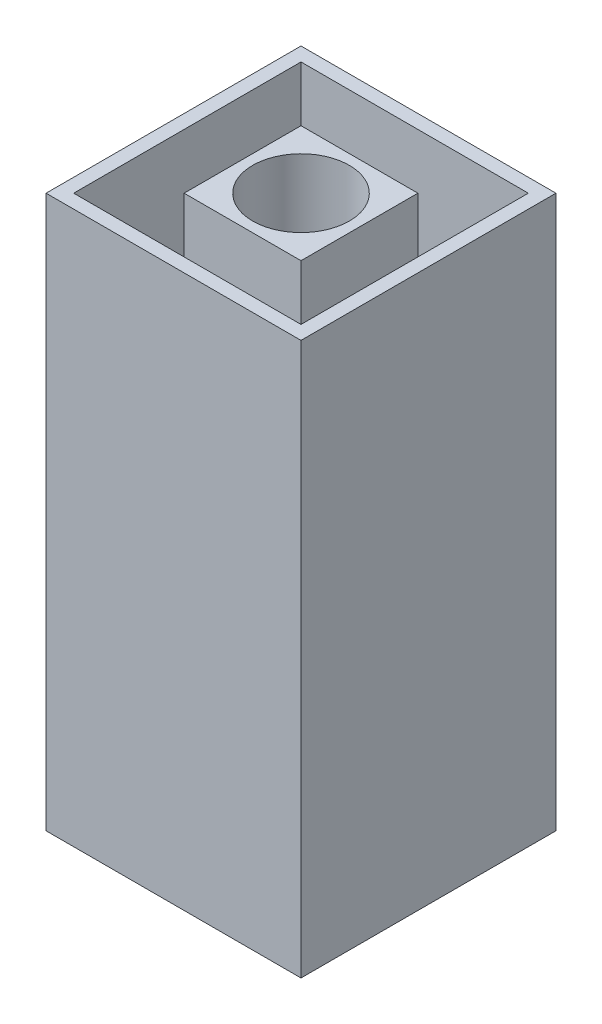
ISO-10303-21;
HEADER;
FILE_DESCRIPTION(('STEP AP214'),'2;1');
FILE_NAME('part.step','',(''),(''),'','','');
FILE_SCHEMA(('AUTOMOTIVE_DESIGN { 1 0 10303 214 1 1 1 1 }'));
ENDSEC;
DATA;
#1=APPLICATION_CONTEXT('core data for automotive mechanical design processes');
#2=APPLICATION_PROTOCOL_DEFINITION('international standard','automotive_design',2000,#1);
#3=PRODUCT_CONTEXT('',#1,'mechanical');
#4=PRODUCT('Part','Part','',(#3));
#5=PRODUCT_RELATED_PRODUCT_CATEGORY('part','',(#4));
#6=PRODUCT_DEFINITION_FORMATION('','',#4);
#7=PRODUCT_DEFINITION_CONTEXT('part definition',#1,'design');
#8=PRODUCT_DEFINITION('design','',#6,#7);
#9=PRODUCT_DEFINITION_SHAPE('','',#8);
#10=(LENGTH_UNIT() NAMED_UNIT(*) SI_UNIT(.MILLI.,.METRE.));
#11=(NAMED_UNIT(*) PLANE_ANGLE_UNIT() SI_UNIT($,.RADIAN.));
#12=(NAMED_UNIT(*) SI_UNIT($,.STERADIAN.) SOLID_ANGLE_UNIT());
#13=UNCERTAINTY_MEASURE_WITH_UNIT(LENGTH_MEASURE(1.E-05),#10,'distance_accuracy_value','');
#14=(GEOMETRIC_REPRESENTATION_CONTEXT(3) GLOBAL_UNCERTAINTY_ASSIGNED_CONTEXT((#13)) GLOBAL_UNIT_ASSIGNED_CONTEXT((#10,
#11,#12)) REPRESENTATION_CONTEXT('',''));
#15=CARTESIAN_POINT('',(0.,0.,0.));
#16=DIRECTION('',(0.,0.,1.));
#17=DIRECTION('',(1.,0.,0.));
#18=AXIS2_PLACEMENT_3D('',#15,#16,#17);
#19=CARTESIAN_POINT('',(1.385,6.,-1.385));
#20=DIRECTION('',(-1.,0.,0.));
#21=DIRECTION('',(0.,0.,1.));
#22=AXIS2_PLACEMENT_3D('',#19,#20,#21);
#23=PLANE('',#22);
#24=DIRECTION('',(0.,0.,-1.));
#25=VECTOR('',#24,1.);
#26=CARTESIAN_POINT('',(1.385,0.,-1.385));
#27=LINE('',#26,#25);
#28=CARTESIAN_POINT('',(1.385,0.,1.385));
#29=VERTEX_POINT('',#28);
#30=CARTESIAN_POINT('',(1.385,0.,-1.385));
#31=VERTEX_POINT('',#30);
#32=EDGE_CURVE('E130',#29,#31,#27,.T.);
#33=ORIENTED_EDGE('',*,*,#32,.T.);
#34=DIRECTION('',(0.,-1.,0.));
#35=VECTOR('',#34,1.);
#36=CARTESIAN_POINT('',(1.385,6.,-1.385));
#37=LINE('',#36,#35);
#38=CARTESIAN_POINT('',(1.385,6.,-1.385));
#39=VERTEX_POINT('',#38);
#40=EDGE_CURVE('E178',#39,#31,#37,.T.);
#41=ORIENTED_EDGE('',*,*,#40,.F.);
#42=DIRECTION('',(0.,0.,-1.));
#43=VECTOR('',#42,1.);
#44=CARTESIAN_POINT('',(1.385,6.,-1.385));
#45=LINE('',#44,#43);
#46=CARTESIAN_POINT('',(1.385,6.,1.385));
#47=VERTEX_POINT('',#46);
#48=EDGE_CURVE('E132',#47,#39,#45,.T.);
#49=ORIENTED_EDGE('',*,*,#48,.F.);
#50=DIRECTION('',(0.,-1.,0.));
#51=VECTOR('',#50,1.);
#52=CARTESIAN_POINT('',(1.385,6.,1.385));
#53=LINE('',#52,#51);
#54=EDGE_CURVE('E118',#47,#29,#53,.T.);
#55=ORIENTED_EDGE('',*,*,#54,.T.);
#56=EDGE_LOOP('',(#33,#41,#49,#55));
#57=FACE_BOUND('',#56,.T.);
#58=ADVANCED_FACE('F42',(#57),#23,.F.);
#59=CARTESIAN_POINT('',(-1.385,6.,-1.385));
#60=DIRECTION('',(0.,0.,1.));
#61=DIRECTION('',(1.,0.,0.));
#62=AXIS2_PLACEMENT_3D('',#59,#60,#61);
#63=PLANE('',#62);
#64=DIRECTION('',(-1.,0.,0.));
#65=VECTOR('',#64,1.);
#66=CARTESIAN_POINT('',(-1.385,0.,-1.385));
#67=LINE('',#66,#65);
#68=CARTESIAN_POINT('',(-1.385,0.,-1.385));
#69=VERTEX_POINT('',#68);
#70=EDGE_CURVE('E133',#31,#69,#67,.T.);
#71=ORIENTED_EDGE('',*,*,#70,.T.);
#72=DIRECTION('',(0.,-1.,0.));
#73=VECTOR('',#72,1.);
#74=CARTESIAN_POINT('',(-1.385,6.,-1.385));
#75=LINE('',#74,#73);
#76=CARTESIAN_POINT('',(-1.385,6.,-1.385));
#77=VERTEX_POINT('',#76);
#78=EDGE_CURVE('E125',#77,#69,#75,.T.);
#79=ORIENTED_EDGE('',*,*,#78,.F.);
#80=DIRECTION('',(-1.,0.,0.));
#81=VECTOR('',#80,1.);
#82=CARTESIAN_POINT('',(-1.385,6.,-1.385));
#83=LINE('',#82,#81);
#84=EDGE_CURVE('E145',#39,#77,#83,.T.);
#85=ORIENTED_EDGE('',*,*,#84,.F.);
#86=ORIENTED_EDGE('',*,*,#40,.T.);
#87=EDGE_LOOP('',(#71,#79,#85,#86));
#88=FACE_BOUND('',#87,.T.);
#89=ADVANCED_FACE('F188',(#88),#63,.F.);
#90=CARTESIAN_POINT('',(-1.385,6.,-1.385));
#91=DIRECTION('',(1.,0.,0.));
#92=DIRECTION('',(0.,0.,-1.));
#93=AXIS2_PLACEMENT_3D('',#90,#91,#92);
#94=PLANE('',#93);
#95=DIRECTION('',(0.,0.,1.));
#96=VECTOR('',#95,1.);
#97=CARTESIAN_POINT('',(-1.385,0.,-1.385));
#98=LINE('',#97,#96);
#99=CARTESIAN_POINT('',(-1.385,0.,1.385));
#100=VERTEX_POINT('',#99);
#101=EDGE_CURVE('E180',#69,#100,#98,.T.);
#102=ORIENTED_EDGE('',*,*,#101,.T.);
#103=DIRECTION('',(0.,-1.,0.));
#104=VECTOR('',#103,1.);
#105=CARTESIAN_POINT('',(-1.385,6.,1.385));
#106=LINE('',#105,#104);
#107=CARTESIAN_POINT('',(-1.385,6.,1.385));
#108=VERTEX_POINT('',#107);
#109=EDGE_CURVE('E121',#108,#100,#106,.T.);
#110=ORIENTED_EDGE('',*,*,#109,.F.);
#111=DIRECTION('',(0.,0.,1.));
#112=VECTOR('',#111,1.);
#113=CARTESIAN_POINT('',(-1.385,6.,-1.385));
#114=LINE('',#113,#112);
#115=EDGE_CURVE('E143',#77,#108,#114,.T.);
#116=ORIENTED_EDGE('',*,*,#115,.F.);
#117=ORIENTED_EDGE('',*,*,#78,.T.);
#118=EDGE_LOOP('',(#102,#110,#116,#117));
#119=FACE_BOUND('',#118,.T.);
#120=ADVANCED_FACE('F184',(#119),#94,.F.);
#121=CARTESIAN_POINT('',(-1.385,6.,1.385));
#122=DIRECTION('',(0.,0.,-1.));
#123=DIRECTION('',(-1.,0.,0.));
#124=AXIS2_PLACEMENT_3D('',#121,#122,#123);
#125=PLANE('',#124);
#126=DIRECTION('',(1.,0.,0.));
#127=VECTOR('',#126,1.);
#128=CARTESIAN_POINT('',(-1.385,0.,1.385));
#129=LINE('',#128,#127);
#130=EDGE_CURVE('E114',#100,#29,#129,.T.);
#131=ORIENTED_EDGE('',*,*,#130,.T.);
#132=ORIENTED_EDGE('',*,*,#54,.F.);
#133=DIRECTION('',(1.,0.,0.));
#134=VECTOR('',#133,1.);
#135=CARTESIAN_POINT('',(-1.385,6.,1.385));
#136=LINE('',#135,#134);
#137=EDGE_CURVE('E140',#108,#47,#136,.T.);
#138=ORIENTED_EDGE('',*,*,#137,.F.);
#139=ORIENTED_EDGE('',*,*,#109,.T.);
#140=EDGE_LOOP('',(#131,#132,#138,#139));
#141=FACE_BOUND('',#140,.T.);
#142=ADVANCED_FACE('F116',(#141),#125,.F.);
#143=CARTESIAN_POINT('',(1.385,6.,1.385));
#144=DIRECTION('',(0.,1.,0.));
#145=DIRECTION('',(0.,0.,1.));
#146=AXIS2_PLACEMENT_3D('',#143,#144,#145);
#147=PLANE('',#146);
#148=DIRECTION('',(0.,0.,1.));
#149=VECTOR('',#148,1.);
#150=CARTESIAN_POINT('',(-1.235,6.,-1.235));
#151=LINE('',#150,#149);
#152=CARTESIAN_POINT('',(-1.235,6.,-1.235));
#153=VERTEX_POINT('',#152);
#154=CARTESIAN_POINT('',(-1.235,6.,1.235));
#155=VERTEX_POINT('',#154);
#156=EDGE_CURVE('E46',#153,#155,#151,.T.);
#157=ORIENTED_EDGE('',*,*,#156,.F.);
#158=DIRECTION('',(-1.,0.,0.));
#159=VECTOR('',#158,1.);
#160=CARTESIAN_POINT('',(-1.235,6.,-1.235));
#161=LINE('',#160,#159);
#162=CARTESIAN_POINT('',(1.235,6.,-1.235));
#163=VERTEX_POINT('',#162);
#164=EDGE_CURVE('E153',#163,#153,#161,.T.);
#165=ORIENTED_EDGE('',*,*,#164,.F.);
#166=DIRECTION('',(0.,0.,-1.));
#167=VECTOR('',#166,1.);
#168=CARTESIAN_POINT('',(1.235,6.,-1.235));
#169=LINE('',#168,#167);
#170=CARTESIAN_POINT('',(1.235,6.,1.235));
#171=VERTEX_POINT('',#170);
#172=EDGE_CURVE('E149',#171,#163,#169,.T.);
#173=ORIENTED_EDGE('',*,*,#172,.F.);
#174=DIRECTION('',(1.,0.,0.));
#175=VECTOR('',#174,1.);
#176=CARTESIAN_POINT('',(-1.235,6.,1.235));
#177=LINE('',#176,#175);
#178=EDGE_CURVE('E12',#155,#171,#177,.T.);
#179=ORIENTED_EDGE('',*,*,#178,.F.);
#180=EDGE_LOOP('',(#157,#165,#173,#179));
#181=FACE_BOUND('',#180,.T.);
#182=ORIENTED_EDGE('',*,*,#48,.T.);
#183=ORIENTED_EDGE('',*,*,#84,.T.);
#184=ORIENTED_EDGE('',*,*,#115,.T.);
#185=ORIENTED_EDGE('',*,*,#137,.T.);
#186=EDGE_LOOP('',(#182,#183,#184,#185));
#187=FACE_BOUND('',#186,.T.);
#188=ADVANCED_FACE('F168',(#181,#187),#147,.T.);
#189=CARTESIAN_POINT('',(1.385,0.,1.385));
#190=DIRECTION('',(0.,1.,0.));
#191=DIRECTION('',(0.,0.,1.));
#192=AXIS2_PLACEMENT_3D('',#189,#190,#191);
#193=PLANE('',#192);
#194=DIRECTION('',(-1.,0.,0.));
#195=VECTOR('',#194,1.);
#196=CARTESIAN_POINT('',(1.385,0.,-1.235));
#197=LINE('',#196,#195);
#198=CARTESIAN_POINT('',(1.235,0.,-1.235));
#199=VERTEX_POINT('',#198);
#200=CARTESIAN_POINT('',(-1.235,0.,-1.235));
#201=VERTEX_POINT('',#200);
#202=EDGE_CURVE('E142',#199,#201,#197,.T.);
#203=ORIENTED_EDGE('',*,*,#202,.T.);
#204=DIRECTION('',(0.,0.,1.));
#205=VECTOR('',#204,1.);
#206=CARTESIAN_POINT('',(-1.235,0.,1.385));
#207=LINE('',#206,#205);
#208=CARTESIAN_POINT('',(-1.235,0.,1.235));
#209=VERTEX_POINT('',#208);
#210=EDGE_CURVE('E83',#201,#209,#207,.T.);
#211=ORIENTED_EDGE('',*,*,#210,.T.);
#212=DIRECTION('',(1.,0.,0.));
#213=VECTOR('',#212,1.);
#214=CARTESIAN_POINT('',(1.385,0.,1.235));
#215=LINE('',#214,#213);
#216=CARTESIAN_POINT('',(1.235,0.,1.235));
#217=VERTEX_POINT('',#216);
#218=EDGE_CURVE('E60',#209,#217,#215,.T.);
#219=ORIENTED_EDGE('',*,*,#218,.T.);
#220=DIRECTION('',(0.,0.,-1.));
#221=VECTOR('',#220,1.);
#222=CARTESIAN_POINT('',(1.235,0.,1.385));
#223=LINE('',#222,#221);
#224=EDGE_CURVE('E157',#217,#199,#223,.T.);
#225=ORIENTED_EDGE('',*,*,#224,.T.);
#226=EDGE_LOOP('',(#203,#211,#219,#225));
#227=FACE_BOUND('',#226,.T.);
#228=ORIENTED_EDGE('',*,*,#32,.F.);
#229=ORIENTED_EDGE('',*,*,#130,.F.);
#230=ORIENTED_EDGE('',*,*,#101,.F.);
#231=ORIENTED_EDGE('',*,*,#70,.F.);
#232=EDGE_LOOP('',(#228,#229,#230,#231));
#233=FACE_BOUND('',#232,.T.);
#234=ADVANCED_FACE('F44',(#227,#233),#193,.F.);
#235=CARTESIAN_POINT('',(-1.235,-4.,-1.235));
#236=DIRECTION('',(-1.,0.,0.));
#237=DIRECTION('',(0.,0.,1.));
#238=AXIS2_PLACEMENT_3D('',#235,#236,#237);
#239=PLANE('',#238);
#240=DIRECTION('',(0.,1.,0.));
#241=VECTOR('',#240,1.);
#242=CARTESIAN_POINT('',(-1.235,-4.,-1.235));
#243=LINE('',#242,#241);
#244=EDGE_CURVE('E155',#201,#153,#243,.T.);
#245=ORIENTED_EDGE('',*,*,#244,.T.);
#246=ORIENTED_EDGE('',*,*,#156,.T.);
#247=DIRECTION('',(0.,1.,0.));
#248=VECTOR('',#247,1.);
#249=CARTESIAN_POINT('',(-1.235,-4.,1.235));
#250=LINE('',#249,#248);
#251=EDGE_CURVE('E52',#209,#155,#250,.T.);
#252=ORIENTED_EDGE('',*,*,#251,.F.);
#253=ORIENTED_EDGE('',*,*,#210,.F.);
#254=EDGE_LOOP('',(#245,#246,#252,#253));
#255=FACE_BOUND('',#254,.T.);
#256=ADVANCED_FACE('F194',(#255),#239,.F.);
#257=CARTESIAN_POINT('',(-1.235,-4.,-1.235));
#258=DIRECTION('',(0.,0.,-1.));
#259=DIRECTION('',(-1.,0.,0.));
#260=AXIS2_PLACEMENT_3D('',#257,#258,#259);
#261=PLANE('',#260);
#262=DIRECTION('',(0.,1.,0.));
#263=VECTOR('',#262,1.);
#264=CARTESIAN_POINT('',(1.235,-4.,-1.235));
#265=LINE('',#264,#263);
#266=EDGE_CURVE('E78',#199,#163,#265,.T.);
#267=ORIENTED_EDGE('',*,*,#266,.T.);
#268=ORIENTED_EDGE('',*,*,#164,.T.);
#269=ORIENTED_EDGE('',*,*,#244,.F.);
#270=ORIENTED_EDGE('',*,*,#202,.F.);
#271=EDGE_LOOP('',(#267,#268,#269,#270));
#272=FACE_BOUND('',#271,.T.);
#273=ADVANCED_FACE('F170',(#272),#261,.F.);
#274=CARTESIAN_POINT('',(1.235,-4.,-1.235));
#275=DIRECTION('',(1.,0.,0.));
#276=DIRECTION('',(0.,0.,-1.));
#277=AXIS2_PLACEMENT_3D('',#274,#275,#276);
#278=PLANE('',#277);
#279=DIRECTION('',(0.,1.,0.));
#280=VECTOR('',#279,1.);
#281=CARTESIAN_POINT('',(1.235,-4.,1.235));
#282=LINE('',#281,#280);
#283=EDGE_CURVE('E150',#217,#171,#282,.T.);
#284=ORIENTED_EDGE('',*,*,#283,.T.);
#285=ORIENTED_EDGE('',*,*,#172,.T.);
#286=ORIENTED_EDGE('',*,*,#266,.F.);
#287=ORIENTED_EDGE('',*,*,#224,.F.);
#288=EDGE_LOOP('',(#284,#285,#286,#287));
#289=FACE_BOUND('',#288,.T.);
#290=ADVANCED_FACE('F162',(#289),#278,.F.);
#291=CARTESIAN_POINT('',(-1.235,-4.,1.235));
#292=DIRECTION('',(0.,0.,1.));
#293=DIRECTION('',(1.,0.,0.));
#294=AXIS2_PLACEMENT_3D('',#291,#292,#293);
#295=PLANE('',#294);
#296=ORIENTED_EDGE('',*,*,#251,.T.);
#297=ORIENTED_EDGE('',*,*,#178,.T.);
#298=ORIENTED_EDGE('',*,*,#283,.F.);
#299=ORIENTED_EDGE('',*,*,#218,.F.);
#300=EDGE_LOOP('',(#296,#297,#298,#299));
#301=FACE_BOUND('',#300,.T.);
#302=ADVANCED_FACE('F208',(#301),#295,.F.);
#303=CLOSED_SHELL('',(#58,#89,#120,#142,#188,#234,#256,#273,#290,#302));
#304=MANIFOLD_SOLID_BREP('B2',#303);
#305=CARTESIAN_POINT('',(1.385,6.,1.385));
#306=DIRECTION('',(0.,1.,0.));
#307=DIRECTION('',(0.,0.,1.));
#308=AXIS2_PLACEMENT_3D('',#305,#306,#307);
#309=PLANE('',#308);
#310=CARTESIAN_POINT('',(0.,6.,0.));
#311=DIRECTION('',(0.,1.,0.));
#312=DIRECTION('',(0.,0.,1.));
#313=AXIS2_PLACEMENT_3D('',#310,#311,#312);
#314=CIRCLE('',#313,0.525);
#315=CARTESIAN_POINT('',(0.,6.,0.525));
#316=VERTEX_POINT('',#315);
#317=EDGE_CURVE('E335',#316,#316,#314,.T.);
#318=ORIENTED_EDGE('',*,*,#317,.F.);
#319=EDGE_LOOP('',(#318));
#320=FACE_BOUND('',#319,.T.);
#321=DIRECTION('',(-1.,0.,0.));
#322=VECTOR('',#321,1.);
#323=CARTESIAN_POINT('',(-0.635000000000001,6.,-0.635000000000001));
#324=LINE('',#323,#322);
#325=CARTESIAN_POINT('',(0.634999999999998,6.,-0.635000000000001));
#326=VERTEX_POINT('',#325);
#327=CARTESIAN_POINT('',(-0.635000000000001,6.,-0.635000000000001));
#328=VERTEX_POINT('',#327);
#329=EDGE_CURVE('E321',#326,#328,#324,.T.);
#330=ORIENTED_EDGE('',*,*,#329,.T.);
#331=DIRECTION('',(0.,0.,1.));
#332=VECTOR('',#331,1.);
#333=CARTESIAN_POINT('',(-0.635000000000001,6.,-0.635000000000001));
#334=LINE('',#333,#332);
#335=CARTESIAN_POINT('',(-0.635000000000001,6.,0.635000000000001));
#336=VERTEX_POINT('',#335);
#337=EDGE_CURVE('E331',#328,#336,#334,.T.);
#338=ORIENTED_EDGE('',*,*,#337,.T.);
#339=DIRECTION('',(1.,0.,0.));
#340=VECTOR('',#339,1.);
#341=CARTESIAN_POINT('',(-0.635000000000001,6.,0.635000000000001));
#342=LINE('',#341,#340);
#343=CARTESIAN_POINT('',(0.634999999999998,6.,0.635000000000001));
#344=VERTEX_POINT('',#343);
#345=EDGE_CURVE('E329',#336,#344,#342,.T.);
#346=ORIENTED_EDGE('',*,*,#345,.T.);
#347=DIRECTION('',(0.,0.,-1.));
#348=VECTOR('',#347,1.);
#349=CARTESIAN_POINT('',(0.634999999999998,6.,-0.635000000000001));
#350=LINE('',#349,#348);
#351=EDGE_CURVE('E286',#344,#326,#350,.T.);
#352=ORIENTED_EDGE('',*,*,#351,.T.);
#353=EDGE_LOOP('',(#330,#338,#346,#352));
#354=FACE_BOUND('',#353,.T.);
#355=ADVANCED_FACE('F271',(#320,#354),#309,.T.);
#356=CARTESIAN_POINT('',(0.,0.,0.));
#357=DIRECTION('',(0.,1.,0.));
#358=DIRECTION('',(0.,0.,1.));
#359=AXIS2_PLACEMENT_3D('',#356,#357,#358);
#360=CYLINDRICAL_SURFACE('',#359,0.525);
#361=CARTESIAN_POINT('',(0.,0.,0.));
#362=DIRECTION('',(0.,1.,0.));
#363=DIRECTION('',(0.,0.,1.));
#364=AXIS2_PLACEMENT_3D('',#361,#362,#363);
#365=CIRCLE('',#364,0.525);
#366=CARTESIAN_POINT('',(0.,0.,0.525));
#367=VERTEX_POINT('',#366);
#368=EDGE_CURVE('E339',#367,#367,#365,.T.);
#369=ORIENTED_EDGE('',*,*,#368,.F.);
#370=EDGE_LOOP('',(#369));
#371=FACE_BOUND('',#370,.T.);
#372=ORIENTED_EDGE('',*,*,#317,.T.);
#373=EDGE_LOOP('',(#372));
#374=FACE_BOUND('',#373,.T.);
#375=ADVANCED_FACE('F359',(#371,#374),#360,.F.);
#376=CARTESIAN_POINT('',(1.385,0.,1.385));
#377=DIRECTION('',(0.,1.,0.));
#378=DIRECTION('',(0.,0.,1.));
#379=AXIS2_PLACEMENT_3D('',#376,#377,#378);
#380=PLANE('',#379);
#381=ORIENTED_EDGE('',*,*,#368,.T.);
#382=EDGE_LOOP('',(#381));
#383=FACE_BOUND('',#382,.T.);
#384=DIRECTION('',(0.,0.,1.));
#385=VECTOR('',#384,1.);
#386=CARTESIAN_POINT('',(-0.635000000000001,0.,1.385));
#387=LINE('',#386,#385);
#388=CARTESIAN_POINT('',(-0.635000000000001,0.,-0.635000000000001));
#389=VERTEX_POINT('',#388);
#390=CARTESIAN_POINT('',(-0.635000000000001,0.,0.635000000000001));
#391=VERTEX_POINT('',#390);
#392=EDGE_CURVE('E40',#389,#391,#387,.T.);
#393=ORIENTED_EDGE('',*,*,#392,.F.);
#394=DIRECTION('',(-1.,0.,0.));
#395=VECTOR('',#394,1.);
#396=CARTESIAN_POINT('',(1.385,0.,-0.635000000000001));
#397=LINE('',#396,#395);
#398=CARTESIAN_POINT('',(0.634999999999998,0.,-0.635000000000001));
#399=VERTEX_POINT('',#398);
#400=EDGE_CURVE('E279',#399,#389,#397,.T.);
#401=ORIENTED_EDGE('',*,*,#400,.F.);
#402=DIRECTION('',(0.,0.,-1.));
#403=VECTOR('',#402,1.);
#404=CARTESIAN_POINT('',(0.634999999999998,0.,1.385));
#405=LINE('',#404,#403);
#406=CARTESIAN_POINT('',(0.634999999999998,0.,0.635000000000001));
#407=VERTEX_POINT('',#406);
#408=EDGE_CURVE('E314',#407,#399,#405,.T.);
#409=ORIENTED_EDGE('',*,*,#408,.F.);
#410=DIRECTION('',(1.,0.,0.));
#411=VECTOR('',#410,1.);
#412=CARTESIAN_POINT('',(1.385,0.,0.635000000000001));
#413=LINE('',#412,#411);
#414=EDGE_CURVE('E342',#391,#407,#413,.T.);
#415=ORIENTED_EDGE('',*,*,#414,.F.);
#416=EDGE_LOOP('',(#393,#401,#409,#415));
#417=FACE_BOUND('',#416,.T.);
#418=ADVANCED_FACE('F273',(#383,#417),#380,.F.);
#419=CARTESIAN_POINT('',(-0.635000000000001,-4.,0.635000000000001));
#420=DIRECTION('',(0.,0.,1.));
#421=DIRECTION('',(1.,0.,0.));
#422=AXIS2_PLACEMENT_3D('',#419,#420,#421);
#423=PLANE('',#422);
#424=ORIENTED_EDGE('',*,*,#414,.T.);
#425=DIRECTION('',(0.,1.,0.));
#426=VECTOR('',#425,1.);
#427=CARTESIAN_POINT('',(0.634999999999998,-4.,0.635000000000001));
#428=LINE('',#427,#426);
#429=EDGE_CURVE('E318',#407,#344,#428,.T.);
#430=ORIENTED_EDGE('',*,*,#429,.T.);
#431=ORIENTED_EDGE('',*,*,#345,.F.);
#432=DIRECTION('',(0.,1.,0.));
#433=VECTOR('',#432,1.);
#434=CARTESIAN_POINT('',(-0.635000000000001,-4.,0.635000000000001));
#435=LINE('',#434,#433);
#436=EDGE_CURVE('E294',#391,#336,#435,.T.);
#437=ORIENTED_EDGE('',*,*,#436,.F.);
#438=EDGE_LOOP('',(#424,#430,#431,#437));
#439=FACE_BOUND('',#438,.T.);
#440=ADVANCED_FACE('F351',(#439),#423,.T.);
#441=CARTESIAN_POINT('',(0.634999999999998,-4.,-0.635000000000001));
#442=DIRECTION('',(1.,0.,0.));
#443=DIRECTION('',(0.,0.,-1.));
#444=AXIS2_PLACEMENT_3D('',#441,#442,#443);
#445=PLANE('',#444);
#446=ORIENTED_EDGE('',*,*,#408,.T.);
#447=DIRECTION('',(0.,1.,0.));
#448=VECTOR('',#447,1.);
#449=CARTESIAN_POINT('',(0.634999999999998,-4.,-0.635000000000001));
#450=LINE('',#449,#448);
#451=EDGE_CURVE('E310',#399,#326,#450,.T.);
#452=ORIENTED_EDGE('',*,*,#451,.T.);
#453=ORIENTED_EDGE('',*,*,#351,.F.);
#454=ORIENTED_EDGE('',*,*,#429,.F.);
#455=EDGE_LOOP('',(#446,#452,#453,#454));
#456=FACE_BOUND('',#455,.T.);
#457=ADVANCED_FACE('F312',(#456),#445,.T.);
#458=CARTESIAN_POINT('',(-0.635000000000001,-4.,-0.635000000000001));
#459=DIRECTION('',(0.,0.,-1.));
#460=DIRECTION('',(-1.,0.,0.));
#461=AXIS2_PLACEMENT_3D('',#458,#459,#460);
#462=PLANE('',#461);
#463=ORIENTED_EDGE('',*,*,#400,.T.);
#464=DIRECTION('',(0.,1.,0.));
#465=VECTOR('',#464,1.);
#466=CARTESIAN_POINT('',(-0.635000000000001,-4.,-0.635000000000001));
#467=LINE('',#466,#465);
#468=EDGE_CURVE('E317',#389,#328,#467,.T.);
#469=ORIENTED_EDGE('',*,*,#468,.T.);
#470=ORIENTED_EDGE('',*,*,#329,.F.);
#471=ORIENTED_EDGE('',*,*,#451,.F.);
#472=EDGE_LOOP('',(#463,#469,#470,#471));
#473=FACE_BOUND('',#472,.T.);
#474=ADVANCED_FACE('F322',(#473),#462,.T.);
#475=CARTESIAN_POINT('',(-0.635000000000001,-4.,-0.635000000000001));
#476=DIRECTION('',(-1.,0.,0.));
#477=DIRECTION('',(0.,0.,1.));
#478=AXIS2_PLACEMENT_3D('',#475,#476,#477);
#479=PLANE('',#478);
#480=ORIENTED_EDGE('',*,*,#392,.T.);
#481=ORIENTED_EDGE('',*,*,#436,.T.);
#482=ORIENTED_EDGE('',*,*,#337,.F.);
#483=ORIENTED_EDGE('',*,*,#468,.F.);
#484=EDGE_LOOP('',(#480,#481,#482,#483));
#485=FACE_BOUND('',#484,.T.);
#486=ADVANCED_FACE('F349',(#485),#479,.T.);
#487=CLOSED_SHELL('',(#355,#375,#418,#440,#457,#474,#486));
#488=MANIFOLD_SOLID_BREP('B6',#487);
#489=ADVANCED_BREP_SHAPE_REPRESENTATION('',(#18,#304,#488),#14);
#490=SHAPE_DEFINITION_REPRESENTATION(#9,#489);
ENDSEC;
END-ISO-10303-21;
